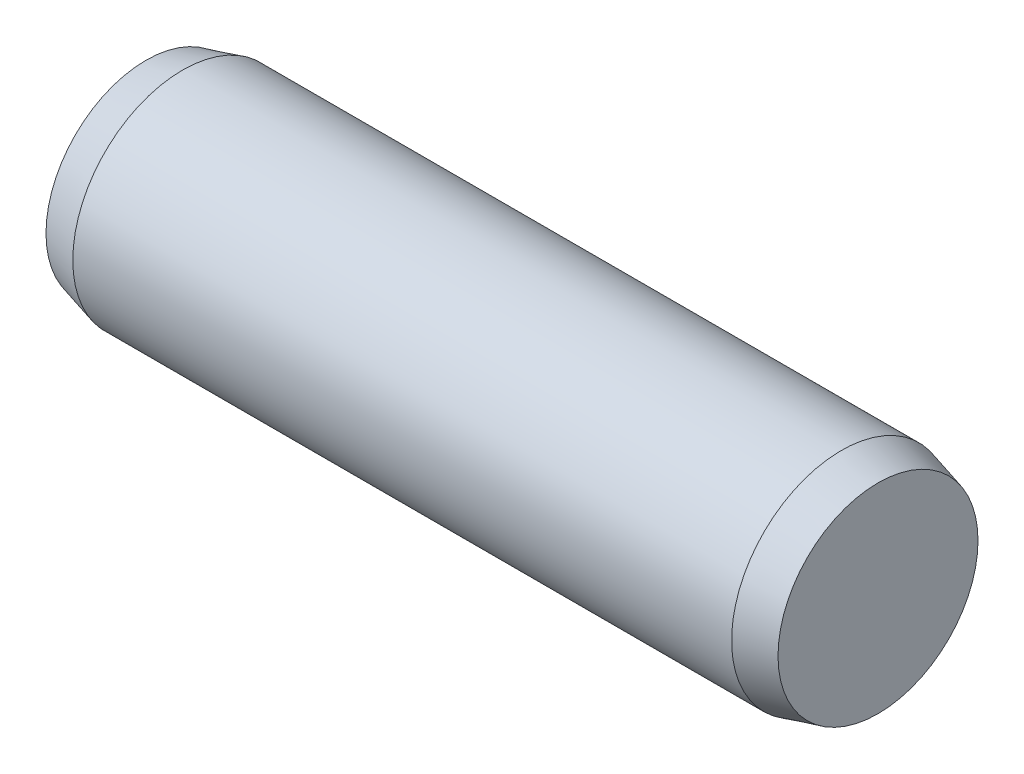
ISO-10303-21;
HEADER;
FILE_DESCRIPTION(('STEP AP214'),'2;1');
FILE_NAME('part.step','',(''),(''),'','','');
FILE_SCHEMA(('AUTOMOTIVE_DESIGN { 1 0 10303 214 1 1 1 1 }'));
ENDSEC;
DATA;
#1=APPLICATION_CONTEXT('core data for automotive mechanical design processes');
#2=APPLICATION_PROTOCOL_DEFINITION('international standard','automotive_design',2000,#1);
#3=PRODUCT_CONTEXT('',#1,'mechanical');
#4=PRODUCT('Part','Part','',(#3));
#5=PRODUCT_RELATED_PRODUCT_CATEGORY('part','',(#4));
#6=PRODUCT_DEFINITION_FORMATION('','',#4);
#7=PRODUCT_DEFINITION_CONTEXT('part definition',#1,'design');
#8=PRODUCT_DEFINITION('design','',#6,#7);
#9=PRODUCT_DEFINITION_SHAPE('','',#8);
#10=(LENGTH_UNIT() NAMED_UNIT(*) SI_UNIT(.MILLI.,.METRE.));
#11=(NAMED_UNIT(*) PLANE_ANGLE_UNIT() SI_UNIT($,.RADIAN.));
#12=(NAMED_UNIT(*) SI_UNIT($,.STERADIAN.) SOLID_ANGLE_UNIT());
#13=UNCERTAINTY_MEASURE_WITH_UNIT(LENGTH_MEASURE(1.E-05),#10,'distance_accuracy_value','');
#14=(GEOMETRIC_REPRESENTATION_CONTEXT(3) GLOBAL_UNCERTAINTY_ASSIGNED_CONTEXT((#13)) GLOBAL_UNIT_ASSIGNED_CONTEXT((#10,
#11,#12)) REPRESENTATION_CONTEXT('',''));
#15=CARTESIAN_POINT('',(0.,0.,0.));
#16=DIRECTION('',(0.,0.,1.));
#17=DIRECTION('',(1.,0.,0.));
#18=AXIS2_PLACEMENT_3D('',#15,#16,#17);
#19=CARTESIAN_POINT('',(-4.5,0.,0.));
#20=DIRECTION('',(1.,0.,0.));
#21=DIRECTION('',(0.,0.,-1.));
#22=AXIS2_PLACEMENT_3D('',#19,#20,#21);
#23=CYLINDRICAL_SURFACE('',#22,1.5);
#24=CARTESIAN_POINT('',(-4.5,0.,0.));
#25=DIRECTION('',(-1.,0.,0.));
#26=DIRECTION('',(0.,0.,1.));
#27=AXIS2_PLACEMENT_3D('',#24,#25,#26);
#28=CIRCLE('',#27,1.5);
#29=CARTESIAN_POINT('',(-4.5,0.,1.5));
#30=VERTEX_POINT('',#29);
#31=EDGE_CURVE('E47',#30,#30,#28,.T.);
#32=ORIENTED_EDGE('',*,*,#31,.F.);
#33=EDGE_LOOP('',(#32));
#34=FACE_BOUND('',#33,.T.);
#35=CARTESIAN_POINT('',(4.5,0.,0.));
#36=DIRECTION('',(1.,0.,0.));
#37=DIRECTION('',(0.,0.,-1.));
#38=AXIS2_PLACEMENT_3D('',#35,#36,#37);
#39=CIRCLE('',#38,1.5);
#40=CARTESIAN_POINT('',(4.5,0.,-1.5));
#41=VERTEX_POINT('',#40);
#42=EDGE_CURVE('E10',#41,#41,#39,.T.);
#43=ORIENTED_EDGE('',*,*,#42,.F.);
#44=EDGE_LOOP('',(#43));
#45=FACE_BOUND('',#44,.T.);
#46=ADVANCED_FACE('F33',(#34,#45),#23,.T.);
#47=CARTESIAN_POINT('',(4.5,0.,0.));
#48=DIRECTION('',(-1.,0.,0.));
#49=DIRECTION('',(0.,0.,-1.));
#50=AXIS2_PLACEMENT_3D('',#47,#48,#49);
#51=CONICAL_SURFACE('',#50,1.5,0.26179938779915);
#52=CARTESIAN_POINT('',(5.,0.,0.));
#53=DIRECTION('',(1.,0.,0.));
#54=DIRECTION('',(0.,0.,-1.));
#55=AXIS2_PLACEMENT_3D('',#52,#53,#54);
#56=CIRCLE('',#55,1.36602540378444);
#57=CARTESIAN_POINT('',(5.,0.,-1.36602540378444));
#58=VERTEX_POINT('',#57);
#59=EDGE_CURVE('E39',#58,#58,#56,.T.);
#60=ORIENTED_EDGE('',*,*,#59,.F.);
#61=EDGE_LOOP('',(#60));
#62=FACE_BOUND('',#61,.T.);
#63=ORIENTED_EDGE('',*,*,#42,.T.);
#64=EDGE_LOOP('',(#63));
#65=FACE_BOUND('',#64,.T.);
#66=ADVANCED_FACE('F57',(#62,#65),#51,.T.);
#67=CARTESIAN_POINT('',(5.,0.,0.));
#68=DIRECTION('',(1.,0.,0.));
#69=DIRECTION('',(0.,0.,-1.));
#70=AXIS2_PLACEMENT_3D('',#67,#68,#69);
#71=PLANE('',#70);
#72=ORIENTED_EDGE('',*,*,#59,.T.);
#73=EDGE_LOOP('',(#72));
#74=FACE_BOUND('',#73,.T.);
#75=ADVANCED_FACE('F61',(#74),#71,.T.);
#76=CARTESIAN_POINT('',(-4.5,0.,0.));
#77=DIRECTION('',(1.,0.,0.));
#78=DIRECTION('',(0.,0.,1.));
#79=AXIS2_PLACEMENT_3D('',#76,#77,#78);
#80=CONICAL_SURFACE('',#79,1.5,0.26179938779915);
#81=CARTESIAN_POINT('',(-5.,0.,0.));
#82=DIRECTION('',(-1.,0.,0.));
#83=DIRECTION('',(0.,0.,1.));
#84=AXIS2_PLACEMENT_3D('',#81,#82,#83);
#85=CIRCLE('',#84,1.36602540378444);
#86=CARTESIAN_POINT('',(-5.,0.,1.36602540378444));
#87=VERTEX_POINT('',#86);
#88=EDGE_CURVE('E43',#87,#87,#85,.T.);
#89=ORIENTED_EDGE('',*,*,#88,.F.);
#90=EDGE_LOOP('',(#89));
#91=FACE_BOUND('',#90,.T.);
#92=ORIENTED_EDGE('',*,*,#31,.T.);
#93=EDGE_LOOP('',(#92));
#94=FACE_BOUND('',#93,.T.);
#95=ADVANCED_FACE('F53',(#91,#94),#80,.T.);
#96=CARTESIAN_POINT('',(-5.,0.,0.));
#97=DIRECTION('',(-1.,0.,0.));
#98=DIRECTION('',(0.,0.,1.));
#99=AXIS2_PLACEMENT_3D('',#96,#97,#98);
#100=PLANE('',#99);
#101=ORIENTED_EDGE('',*,*,#88,.T.);
#102=EDGE_LOOP('',(#101));
#103=FACE_BOUND('',#102,.T.);
#104=ADVANCED_FACE('F70',(#103),#100,.T.);
#105=CLOSED_SHELL('',(#46,#66,#75,#95,#104));
#106=MANIFOLD_SOLID_BREP('B2',#105);
#107=ADVANCED_BREP_SHAPE_REPRESENTATION('',(#18,#106),#14);
#108=SHAPE_DEFINITION_REPRESENTATION(#9,#107);
ENDSEC;
END-ISO-10303-21;
